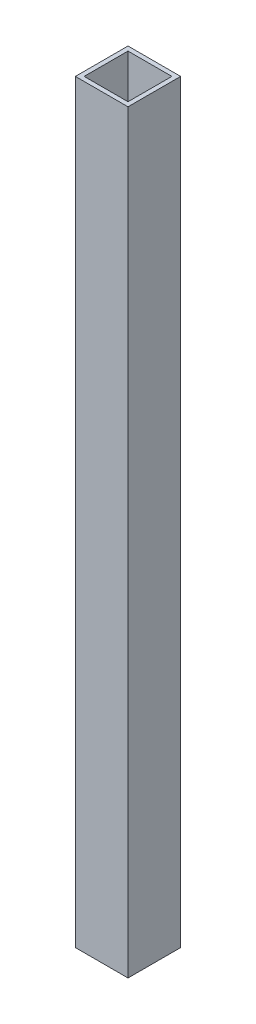
ISO-10303-21;
HEADER;
FILE_DESCRIPTION(('STEP AP214'),'2;1');
FILE_NAME('part.step','',(''),(''),'','','');
FILE_SCHEMA(('AUTOMOTIVE_DESIGN { 1 0 10303 214 1 1 1 1 }'));
ENDSEC;
DATA;
#1=APPLICATION_CONTEXT('core data for automotive mechanical design processes');
#2=APPLICATION_PROTOCOL_DEFINITION('international standard','automotive_design',2000,#1);
#3=PRODUCT_CONTEXT('',#1,'mechanical');
#4=PRODUCT('Part','Part','',(#3));
#5=PRODUCT_RELATED_PRODUCT_CATEGORY('part','',(#4));
#6=PRODUCT_DEFINITION_FORMATION('','',#4);
#7=PRODUCT_DEFINITION_CONTEXT('part definition',#1,'design');
#8=PRODUCT_DEFINITION('design','',#6,#7);
#9=PRODUCT_DEFINITION_SHAPE('','',#8);
#10=(LENGTH_UNIT() NAMED_UNIT(*) SI_UNIT(.MILLI.,.METRE.));
#11=(NAMED_UNIT(*) PLANE_ANGLE_UNIT() SI_UNIT($,.RADIAN.));
#12=(NAMED_UNIT(*) SI_UNIT($,.STERADIAN.) SOLID_ANGLE_UNIT());
#13=UNCERTAINTY_MEASURE_WITH_UNIT(LENGTH_MEASURE(1.E-05),#10,'distance_accuracy_value','');
#14=(GEOMETRIC_REPRESENTATION_CONTEXT(3) GLOBAL_UNCERTAINTY_ASSIGNED_CONTEXT((#13)) GLOBAL_UNIT_ASSIGNED_CONTEXT((#10,
#11,#12)) REPRESENTATION_CONTEXT('',''));
#15=CARTESIAN_POINT('',(0.,0.,0.));
#16=DIRECTION('',(0.,0.,1.));
#17=DIRECTION('',(1.,0.,0.));
#18=AXIS2_PLACEMENT_3D('',#15,#16,#17);
#19=CARTESIAN_POINT('',(0.,546.1,0.));
#20=DIRECTION('',(0.,-1.,0.));
#21=DIRECTION('',(0.,0.,-1.));
#22=AXIS2_PLACEMENT_3D('',#19,#20,#21);
#23=PLANE('',#22);
#24=DIRECTION('',(0.,0.,1.));
#25=VECTOR('',#24,1.);
#26=CARTESIAN_POINT('',(0.,546.1,0.));
#27=LINE('',#26,#25);
#28=CARTESIAN_POINT('',(0.,546.1,-38.1));
#29=VERTEX_POINT('',#28);
#30=CARTESIAN_POINT('',(0.,546.1,0.));
#31=VERTEX_POINT('',#30);
#32=EDGE_CURVE('E133',#29,#31,#27,.T.);
#33=ORIENTED_EDGE('',*,*,#32,.T.);
#34=DIRECTION('',(1.,0.,0.));
#35=VECTOR('',#34,1.);
#36=CARTESIAN_POINT('',(0.,546.1,0.));
#37=LINE('',#36,#35);
#38=CARTESIAN_POINT('',(38.1,546.1,0.));
#39=VERTEX_POINT('',#38);
#40=EDGE_CURVE('E136',#31,#39,#37,.T.);
#41=ORIENTED_EDGE('',*,*,#40,.T.);
#42=DIRECTION('',(0.,0.,-1.));
#43=VECTOR('',#42,1.);
#44=CARTESIAN_POINT('',(38.1,546.1,0.));
#45=LINE('',#44,#43);
#46=CARTESIAN_POINT('',(38.1,546.1,-38.1));
#47=VERTEX_POINT('',#46);
#48=EDGE_CURVE('E139',#39,#47,#45,.T.);
#49=ORIENTED_EDGE('',*,*,#48,.T.);
#50=DIRECTION('',(-1.,0.,0.));
#51=VECTOR('',#50,1.);
#52=CARTESIAN_POINT('',(0.,546.1,-38.1));
#53=LINE('',#52,#51);
#54=EDGE_CURVE('E141',#47,#29,#53,.T.);
#55=ORIENTED_EDGE('',*,*,#54,.T.);
#56=EDGE_LOOP('',(#33,#41,#49,#55));
#57=FACE_BOUND('',#56,.T.);
#58=DIRECTION('',(0.,0.,1.));
#59=VECTOR('',#58,1.);
#60=CARTESIAN_POINT('',(3.17500000000001,546.1,-3.17500000000004));
#61=LINE('',#60,#59);
#62=CARTESIAN_POINT('',(3.17500000000001,546.1,-34.925));
#63=VERTEX_POINT('',#62);
#64=CARTESIAN_POINT('',(3.17500000000001,546.1,-3.17500000000004));
#65=VERTEX_POINT('',#64);
#66=EDGE_CURVE('E97',#63,#65,#61,.T.);
#67=ORIENTED_EDGE('',*,*,#66,.F.);
#68=DIRECTION('',(-1.,0.,0.));
#69=VECTOR('',#68,1.);
#70=CARTESIAN_POINT('',(3.17500000000001,546.1,-34.925));
#71=LINE('',#70,#69);
#72=CARTESIAN_POINT('',(34.925,546.1,-34.925));
#73=VERTEX_POINT('',#72);
#74=EDGE_CURVE('E119',#73,#63,#71,.T.);
#75=ORIENTED_EDGE('',*,*,#74,.F.);
#76=DIRECTION('',(0.,0.,-1.));
#77=VECTOR('',#76,1.);
#78=CARTESIAN_POINT('',(34.925,546.1,-3.17500000000004));
#79=LINE('',#78,#77);
#80=CARTESIAN_POINT('',(34.925,546.1,-3.17500000000004));
#81=VERTEX_POINT('',#80);
#82=EDGE_CURVE('E117',#81,#73,#79,.T.);
#83=ORIENTED_EDGE('',*,*,#82,.F.);
#84=DIRECTION('',(1.,0.,0.));
#85=VECTOR('',#84,1.);
#86=CARTESIAN_POINT('',(3.17500000000001,546.1,-3.17500000000004));
#87=LINE('',#86,#85);
#88=EDGE_CURVE('E105',#65,#81,#87,.T.);
#89=ORIENTED_EDGE('',*,*,#88,.F.);
#90=EDGE_LOOP('',(#67,#75,#83,#89));
#91=FACE_BOUND('',#90,.T.);
#92=ADVANCED_FACE('F32',(#57,#91),#23,.F.);
#93=CARTESIAN_POINT('',(0.,0.,0.));
#94=DIRECTION('',(0.,-1.,0.));
#95=DIRECTION('',(0.,0.,-1.));
#96=AXIS2_PLACEMENT_3D('',#93,#94,#95);
#97=PLANE('',#96);
#98=DIRECTION('',(0.,0.,1.));
#99=VECTOR('',#98,1.);
#100=CARTESIAN_POINT('',(0.,0.,0.));
#101=LINE('',#100,#99);
#102=CARTESIAN_POINT('',(0.,0.,-38.1));
#103=VERTEX_POINT('',#102);
#104=CARTESIAN_POINT('',(0.,0.,0.));
#105=VERTEX_POINT('',#104);
#106=EDGE_CURVE('E113',#103,#105,#101,.T.);
#107=ORIENTED_EDGE('',*,*,#106,.F.);
#108=DIRECTION('',(-1.,0.,0.));
#109=VECTOR('',#108,1.);
#110=CARTESIAN_POINT('',(0.,0.,-38.1));
#111=LINE('',#110,#109);
#112=CARTESIAN_POINT('',(38.1,0.,-38.1));
#113=VERTEX_POINT('',#112);
#114=EDGE_CURVE('E137',#113,#103,#111,.T.);
#115=ORIENTED_EDGE('',*,*,#114,.F.);
#116=DIRECTION('',(0.,0.,-1.));
#117=VECTOR('',#116,1.);
#118=CARTESIAN_POINT('',(38.1,0.,0.));
#119=LINE('',#118,#117);
#120=CARTESIAN_POINT('',(38.1,0.,0.));
#121=VERTEX_POINT('',#120);
#122=EDGE_CURVE('E148',#121,#113,#119,.T.);
#123=ORIENTED_EDGE('',*,*,#122,.F.);
#124=DIRECTION('',(1.,0.,0.));
#125=VECTOR('',#124,1.);
#126=CARTESIAN_POINT('',(0.,0.,0.));
#127=LINE('',#126,#125);
#128=EDGE_CURVE('E146',#105,#121,#127,.T.);
#129=ORIENTED_EDGE('',*,*,#128,.F.);
#130=EDGE_LOOP('',(#107,#115,#123,#129));
#131=FACE_BOUND('',#130,.T.);
#132=DIRECTION('',(-1.,0.,0.));
#133=VECTOR('',#132,1.);
#134=CARTESIAN_POINT('',(3.17500000000001,0.,-34.925));
#135=LINE('',#134,#133);
#136=CARTESIAN_POINT('',(34.925,0.,-34.925));
#137=VERTEX_POINT('',#136);
#138=CARTESIAN_POINT('',(3.17500000000001,0.,-34.925));
#139=VERTEX_POINT('',#138);
#140=EDGE_CURVE('E106',#137,#139,#135,.T.);
#141=ORIENTED_EDGE('',*,*,#140,.T.);
#142=DIRECTION('',(0.,0.,1.));
#143=VECTOR('',#142,1.);
#144=CARTESIAN_POINT('',(3.17500000000001,0.,-3.17500000000004));
#145=LINE('',#144,#143);
#146=CARTESIAN_POINT('',(3.17500000000001,0.,-3.17500000000004));
#147=VERTEX_POINT('',#146);
#148=EDGE_CURVE('E55',#139,#147,#145,.T.);
#149=ORIENTED_EDGE('',*,*,#148,.T.);
#150=DIRECTION('',(1.,0.,0.));
#151=VECTOR('',#150,1.);
#152=CARTESIAN_POINT('',(3.17500000000001,0.,-3.17500000000004));
#153=LINE('',#152,#151);
#154=CARTESIAN_POINT('',(34.925,0.,-3.17500000000004));
#155=VERTEX_POINT('',#154);
#156=EDGE_CURVE('E112',#147,#155,#153,.T.);
#157=ORIENTED_EDGE('',*,*,#156,.T.);
#158=DIRECTION('',(0.,0.,-1.));
#159=VECTOR('',#158,1.);
#160=CARTESIAN_POINT('',(34.925,0.,-3.17500000000004));
#161=LINE('',#160,#159);
#162=EDGE_CURVE('E125',#155,#137,#161,.T.);
#163=ORIENTED_EDGE('',*,*,#162,.T.);
#164=EDGE_LOOP('',(#141,#149,#157,#163));
#165=FACE_BOUND('',#164,.T.);
#166=ADVANCED_FACE('F166',(#131,#165),#97,.T.);
#167=CARTESIAN_POINT('',(0.,546.1,0.));
#168=DIRECTION('',(1.,0.,0.));
#169=DIRECTION('',(0.,0.,-1.));
#170=AXIS2_PLACEMENT_3D('',#167,#168,#169);
#171=PLANE('',#170);
#172=ORIENTED_EDGE('',*,*,#106,.T.);
#173=DIRECTION('',(0.,-1.,0.));
#174=VECTOR('',#173,1.);
#175=CARTESIAN_POINT('',(0.,546.1,0.));
#176=LINE('',#175,#174);
#177=EDGE_CURVE('E11',#31,#105,#176,.T.);
#178=ORIENTED_EDGE('',*,*,#177,.F.);
#179=ORIENTED_EDGE('',*,*,#32,.F.);
#180=DIRECTION('',(0.,-1.,0.));
#181=VECTOR('',#180,1.);
#182=CARTESIAN_POINT('',(0.,546.1,-38.1));
#183=LINE('',#182,#181);
#184=EDGE_CURVE('E143',#29,#103,#183,.T.);
#185=ORIENTED_EDGE('',*,*,#184,.T.);
#186=EDGE_LOOP('',(#172,#178,#179,#185));
#187=FACE_BOUND('',#186,.T.);
#188=ADVANCED_FACE('F34',(#187),#171,.F.);
#189=CARTESIAN_POINT('',(0.,546.1,0.));
#190=DIRECTION('',(0.,0.,-1.));
#191=DIRECTION('',(-1.,0.,0.));
#192=AXIS2_PLACEMENT_3D('',#189,#190,#191);
#193=PLANE('',#192);
#194=ORIENTED_EDGE('',*,*,#128,.T.);
#195=DIRECTION('',(0.,-1.,0.));
#196=VECTOR('',#195,1.);
#197=CARTESIAN_POINT('',(38.1,546.1,0.));
#198=LINE('',#197,#196);
#199=EDGE_CURVE('E40',#39,#121,#198,.T.);
#200=ORIENTED_EDGE('',*,*,#199,.F.);
#201=ORIENTED_EDGE('',*,*,#40,.F.);
#202=ORIENTED_EDGE('',*,*,#177,.T.);
#203=EDGE_LOOP('',(#194,#200,#201,#202));
#204=FACE_BOUND('',#203,.T.);
#205=ADVANCED_FACE('F176',(#204),#193,.F.);
#206=CARTESIAN_POINT('',(38.1,546.1,0.));
#207=DIRECTION('',(-1.,0.,0.));
#208=DIRECTION('',(0.,0.,1.));
#209=AXIS2_PLACEMENT_3D('',#206,#207,#208);
#210=PLANE('',#209);
#211=ORIENTED_EDGE('',*,*,#122,.T.);
#212=DIRECTION('',(0.,-1.,0.));
#213=VECTOR('',#212,1.);
#214=CARTESIAN_POINT('',(38.1,546.1,-38.1));
#215=LINE('',#214,#213);
#216=EDGE_CURVE('E153',#47,#113,#215,.T.);
#217=ORIENTED_EDGE('',*,*,#216,.F.);
#218=ORIENTED_EDGE('',*,*,#48,.F.);
#219=ORIENTED_EDGE('',*,*,#199,.T.);
#220=EDGE_LOOP('',(#211,#217,#218,#219));
#221=FACE_BOUND('',#220,.T.);
#222=ADVANCED_FACE('F160',(#221),#210,.F.);
#223=CARTESIAN_POINT('',(0.,546.1,-38.1));
#224=DIRECTION('',(0.,0.,1.));
#225=DIRECTION('',(1.,0.,0.));
#226=AXIS2_PLACEMENT_3D('',#223,#224,#225);
#227=PLANE('',#226);
#228=ORIENTED_EDGE('',*,*,#114,.T.);
#229=ORIENTED_EDGE('',*,*,#184,.F.);
#230=ORIENTED_EDGE('',*,*,#54,.F.);
#231=ORIENTED_EDGE('',*,*,#216,.T.);
#232=EDGE_LOOP('',(#228,#229,#230,#231));
#233=FACE_BOUND('',#232,.T.);
#234=ADVANCED_FACE('F170',(#233),#227,.F.);
#235=CARTESIAN_POINT('',(3.17500000000001,546.1,-3.17500000000004));
#236=DIRECTION('',(1.,0.,0.));
#237=DIRECTION('',(0.,0.,-1.));
#238=AXIS2_PLACEMENT_3D('',#235,#236,#237);
#239=PLANE('',#238);
#240=ORIENTED_EDGE('',*,*,#148,.F.);
#241=DIRECTION('',(0.,-1.,0.));
#242=VECTOR('',#241,1.);
#243=CARTESIAN_POINT('',(3.17500000000001,546.1,-34.925));
#244=LINE('',#243,#242);
#245=EDGE_CURVE('E101',#63,#139,#244,.T.);
#246=ORIENTED_EDGE('',*,*,#245,.F.);
#247=ORIENTED_EDGE('',*,*,#66,.T.);
#248=DIRECTION('',(0.,-1.,0.));
#249=VECTOR('',#248,1.);
#250=CARTESIAN_POINT('',(3.17500000000001,546.1,-3.17500000000004));
#251=LINE('',#250,#249);
#252=EDGE_CURVE('E100',#65,#147,#251,.T.);
#253=ORIENTED_EDGE('',*,*,#252,.T.);
#254=EDGE_LOOP('',(#240,#246,#247,#253));
#255=FACE_BOUND('',#254,.T.);
#256=ADVANCED_FACE('F99',(#255),#239,.T.);
#257=CARTESIAN_POINT('',(3.17500000000001,546.1,-3.17500000000004));
#258=DIRECTION('',(0.,0.,-1.));
#259=DIRECTION('',(-1.,0.,0.));
#260=AXIS2_PLACEMENT_3D('',#257,#258,#259);
#261=PLANE('',#260);
#262=ORIENTED_EDGE('',*,*,#156,.F.);
#263=ORIENTED_EDGE('',*,*,#252,.F.);
#264=ORIENTED_EDGE('',*,*,#88,.T.);
#265=DIRECTION('',(0.,-1.,0.));
#266=VECTOR('',#265,1.);
#267=CARTESIAN_POINT('',(34.925,546.1,-3.17500000000004));
#268=LINE('',#267,#266);
#269=EDGE_CURVE('E114',#81,#155,#268,.T.);
#270=ORIENTED_EDGE('',*,*,#269,.T.);
#271=EDGE_LOOP('',(#262,#263,#264,#270));
#272=FACE_BOUND('',#271,.T.);
#273=ADVANCED_FACE('F109',(#272),#261,.T.);
#274=CARTESIAN_POINT('',(34.925,546.1,-3.17500000000004));
#275=DIRECTION('',(-1.,0.,0.));
#276=DIRECTION('',(0.,0.,1.));
#277=AXIS2_PLACEMENT_3D('',#274,#275,#276);
#278=PLANE('',#277);
#279=ORIENTED_EDGE('',*,*,#162,.F.);
#280=ORIENTED_EDGE('',*,*,#269,.F.);
#281=ORIENTED_EDGE('',*,*,#82,.T.);
#282=DIRECTION('',(0.,-1.,0.));
#283=VECTOR('',#282,1.);
#284=CARTESIAN_POINT('',(34.925,546.1,-34.925));
#285=LINE('',#284,#283);
#286=EDGE_CURVE('E47',#73,#137,#285,.T.);
#287=ORIENTED_EDGE('',*,*,#286,.T.);
#288=EDGE_LOOP('',(#279,#280,#281,#287));
#289=FACE_BOUND('',#288,.T.);
#290=ADVANCED_FACE('F199',(#289),#278,.T.);
#291=CARTESIAN_POINT('',(3.17500000000001,546.1,-34.925));
#292=DIRECTION('',(0.,0.,1.));
#293=DIRECTION('',(1.,0.,0.));
#294=AXIS2_PLACEMENT_3D('',#291,#292,#293);
#295=PLANE('',#294);
#296=ORIENTED_EDGE('',*,*,#140,.F.);
#297=ORIENTED_EDGE('',*,*,#286,.F.);
#298=ORIENTED_EDGE('',*,*,#74,.T.);
#299=ORIENTED_EDGE('',*,*,#245,.T.);
#300=EDGE_LOOP('',(#296,#297,#298,#299));
#301=FACE_BOUND('',#300,.T.);
#302=ADVANCED_FACE('F203',(#301),#295,.T.);
#303=CLOSED_SHELL('',(#92,#166,#188,#205,#222,#234,#256,#273,#290,#302));
#304=MANIFOLD_SOLID_BREP('B2',#303);
#305=ADVANCED_BREP_SHAPE_REPRESENTATION('',(#18,#304),#14);
#306=SHAPE_DEFINITION_REPRESENTATION(#9,#305);
ENDSEC;
END-ISO-10303-21;
